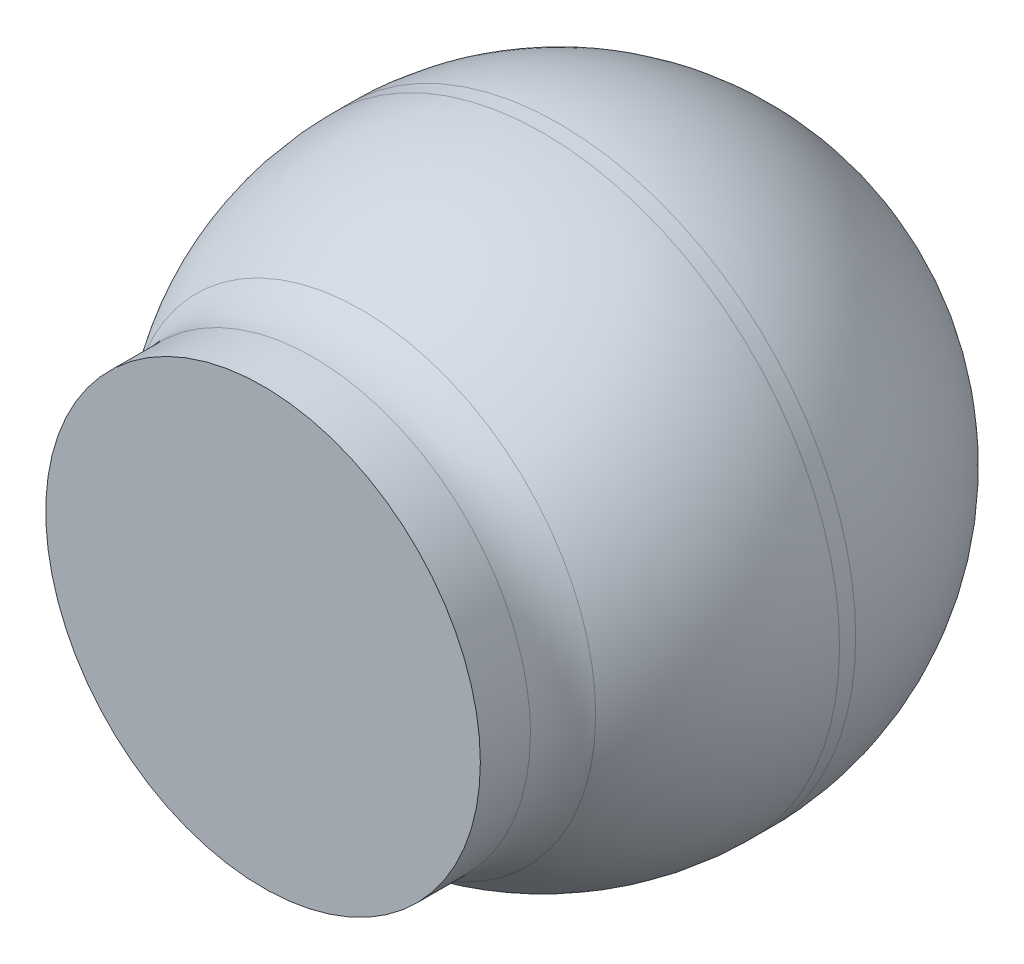
ISO-10303-21;
HEADER;
FILE_DESCRIPTION(('STEP AP214'),'2;1');
FILE_NAME('part.step','',(''),(''),'','','');
FILE_SCHEMA(('AUTOMOTIVE_DESIGN { 1 0 10303 214 1 1 1 1 }'));
ENDSEC;
DATA;
#1=APPLICATION_CONTEXT('core data for automotive mechanical design processes');
#2=APPLICATION_PROTOCOL_DEFINITION('international standard','automotive_design',2000,#1);
#3=PRODUCT_CONTEXT('',#1,'mechanical');
#4=PRODUCT('Part','Part','',(#3));
#5=PRODUCT_RELATED_PRODUCT_CATEGORY('part','',(#4));
#6=PRODUCT_DEFINITION_FORMATION('','',#4);
#7=PRODUCT_DEFINITION_CONTEXT('part definition',#1,'design');
#8=PRODUCT_DEFINITION('design','',#6,#7);
#9=PRODUCT_DEFINITION_SHAPE('','',#8);
#10=(LENGTH_UNIT() NAMED_UNIT(*) SI_UNIT(.MILLI.,.METRE.));
#11=(NAMED_UNIT(*) PLANE_ANGLE_UNIT() SI_UNIT($,.RADIAN.));
#12=(NAMED_UNIT(*) SI_UNIT($,.STERADIAN.) SOLID_ANGLE_UNIT());
#13=UNCERTAINTY_MEASURE_WITH_UNIT(LENGTH_MEASURE(1.E-05),#10,'distance_accuracy_value','');
#14=(GEOMETRIC_REPRESENTATION_CONTEXT(3) GLOBAL_UNCERTAINTY_ASSIGNED_CONTEXT((#13)) GLOBAL_UNIT_ASSIGNED_CONTEXT((#10,
#11,#12)) REPRESENTATION_CONTEXT('',''));
#15=CARTESIAN_POINT('',(0.,0.,0.));
#16=DIRECTION('',(0.,0.,1.));
#17=DIRECTION('',(1.,0.,0.));
#18=AXIS2_PLACEMENT_3D('',#15,#16,#17);
#19=CARTESIAN_POINT('',(1.977080077731,-2.781349291452,10.006534503384));
#20=DIRECTION('',(0.,0.,-1.));
#21=DIRECTION('',(-1.,0.,0.));
#22=AXIS2_PLACEMENT_3D('',#19,#20,#21);
#23=PLANE('',#22);
#24=CARTESIAN_POINT('',(1.977080077731,-2.781349291452,10.006534503384));
#25=DIRECTION('',(0.,0.,1.));
#26=DIRECTION('',(1.,0.,0.));
#27=AXIS2_PLACEMENT_3D('',#24,#25,#26);
#28=CIRCLE('',#27,0.275);
#29=CARTESIAN_POINT('',(2.252080077731,-2.781349291452,10.006534503384));
#30=VERTEX_POINT('',#29);
#31=EDGE_CURVE('E20',#30,#30,#28,.F.);
#32=ORIENTED_EDGE('',*,*,#31,.F.);
#33=EDGE_LOOP('',(#32));
#34=FACE_BOUND('',#33,.T.);
#35=ADVANCED_FACE('F17',(#34),#23,.F.);
#36=CARTESIAN_POINT('',(1.977080077731,-2.781349291452,9.906534503384));
#37=DIRECTION('',(0.,0.,1.));
#38=DIRECTION('',(1.,0.,0.));
#39=AXIS2_PLACEMENT_3D('',#36,#37,#38);
#40=CYLINDRICAL_SURFACE('',#39,0.275);
#41=CARTESIAN_POINT('',(1.977080077731,-2.781349291452,9.943180457728));
#42=DIRECTION('',(0.,0.,-1.));
#43=DIRECTION('',(0.996700902337582,0.0811622527992454,0.));
#44=AXIS2_PLACEMENT_3D('',#41,#42,#43);
#45=CIRCLE('',#44,0.275);
#46=CARTESIAN_POINT('',(2.25117282587384,-2.75902967193221,9.943180457728));
#47=VERTEX_POINT('',#46);
#48=EDGE_CURVE('E65',#47,#47,#45,.F.);
#49=ORIENTED_EDGE('',*,*,#48,.T.);
#50=EDGE_LOOP('',(#49));
#51=FACE_BOUND('',#50,.T.);
#52=ORIENTED_EDGE('',*,*,#31,.T.);
#53=EDGE_LOOP('',(#52));
#54=FACE_BOUND('',#53,.T.);
#55=ADVANCED_FACE('F62',(#51,#54),#40,.T.);
#56=CARTESIAN_POINT('',(1.977080077731,-2.781349291452,9.943180457728));
#57=DIRECTION('',(0.,0.,-1.));
#58=DIRECTION('',(0.996700902337583,0.081162252799246,0.));
#59=AXIS2_PLACEMENT_3D('',#56,#57,#58);
#60=TOROIDAL_SURFACE('',#59,0.375,0.1);
#61=ORIENTED_EDGE('',*,*,#48,.F.);
#62=EDGE_LOOP('',(#61));
#63=FACE_BOUND('',#62,.T.);
#64=CARTESIAN_POINT('',(1.977080077731,-2.781349291452,9.881744931236));
#65=DIRECTION('',(0.,0.,-1.));
#66=DIRECTION('',(-0.996700902337598,-0.0811622527990607,0.));
#67=AXIS2_PLACEMENT_3D('',#64,#65,#66);
#68=CIRCLE('',#67,0.296097046412665);
#69=CARTESIAN_POINT('',(1.681959884392,-2.805381194786,9.881744931236));
#70=VERTEX_POINT('',#69);
#71=EDGE_CURVE('E39',#70,#70,#68,.T.);
#72=ORIENTED_EDGE('',*,*,#71,.F.);
#73=EDGE_LOOP('',(#72));
#74=FACE_BOUND('',#73,.T.);
#75=ADVANCED_FACE('F57',(#63,#74),#60,.F.);
#76=CARTESIAN_POINT('',(1.603317239355,-2.811785136252,9.651976062157));
#77=CARTESIAN_POINT('',(1.603317239355,-2.811785136252,9.701461392103));
#78=CARTESIAN_POINT('',(1.611473782652,-2.811120941579,9.750947004335));
#79=CARTESIAN_POINT('',(1.627792914651,-2.809792059952,9.798626332798));
#80=CARTESIAN_POINT('',(1.651658609162,-2.807848654938,9.842699544317));
#81=CARTESIAN_POINT('',(1.681959884392,-2.805381194786,9.881744931236));
#82=(BOUNDED_CURVE() B_SPLINE_CURVE(5,(#76,#77,#78,#79,#80,#81),.UNSPECIFIED.,.F.,
.F.) B_SPLINE_CURVE_WITH_KNOTS((6,6),(0.,0.661568582165),
.UNSPECIFIED.) CURVE() GEOMETRIC_REPRESENTATION_ITEM() RATIONAL_B_SPLINE_CURVE((1.,1.,1.,1.,1.,1.)) REPRESENTATION_ITEM(''));
#83=CARTESIAN_POINT('',(1.977080077731,-2.781349291452,9.651976062157));
#84=DIRECTION('',(0.,0.,-1.));
#85=AXIS1_PLACEMENT('',#83,#84);
#86=SURFACE_OF_REVOLUTION('',#82,#85);
#87=CARTESIAN_POINT('',(1.977080077731,-2.781349291452,9.651976062157));
#88=DIRECTION('',(0.,0.,1.));
#89=DIRECTION('',(1.,0.,0.));
#90=AXIS2_PLACEMENT_3D('',#87,#88,#89);
#91=CIRCLE('',#90,0.375);
#92=CARTESIAN_POINT('',(2.352080077731,-2.781349291452,9.651976062157));
#93=VERTEX_POINT('',#92);
#94=EDGE_CURVE('E36',#93,#93,#91,.F.);
#95=ORIENTED_EDGE('',*,*,#94,.F.);
#96=EDGE_LOOP('',(#95));
#97=FACE_BOUND('',#96,.T.);
#98=ORIENTED_EDGE('',*,*,#71,.T.);
#99=EDGE_LOOP('',(#98));
#100=FACE_BOUND('',#99,.T.);
#101=ADVANCED_FACE('F53',(#97,#100),#86,.F.);
#102=CARTESIAN_POINT('',(1.977080077731,-2.781349291452,9.256534503384));
#103=DIRECTION('',(0.,0.,1.));
#104=DIRECTION('',(1.,0.,0.));
#105=AXIS2_PLACEMENT_3D('',#102,#103,#104);
#106=CYLINDRICAL_SURFACE('',#105,0.375);
#107=CARTESIAN_POINT('',(1.977080077731,-2.781349291452,9.631534503384));
#108=DIRECTION('',(0.,0.,-1.));
#109=DIRECTION('',(0.0811622527992356,-0.996700902337583,0.));
#110=AXIS2_PLACEMENT_3D('',#107,#108,#109);
#111=CIRCLE('',#110,0.375);
#112=CARTESIAN_POINT('',(2.00751592253071,-3.15511212982859,9.631534503384));
#113=VERTEX_POINT('',#112);
#114=CARTESIAN_POINT('',(1.94664423293129,-2.40758645307541,9.631534503384));
#115=VERTEX_POINT('',#114);
#116=EDGE_CURVE('E11',#113,#115,#111,.T.);
#117=ORIENTED_EDGE('',*,*,#116,.F.);
#118=CARTESIAN_POINT('',(1.977080077731,-2.781349291452,9.631534503384));
#119=DIRECTION('',(0.,0.,1.));
#120=DIRECTION('',(0.0811622527992366,-0.996700902337583,0.));
#121=AXIS2_PLACEMENT_3D('',#118,#119,#120);
#122=CIRCLE('',#121,0.375);
#123=EDGE_CURVE('E25',#115,#113,#122,.F.);
#124=ORIENTED_EDGE('',*,*,#123,.F.);
#125=EDGE_LOOP('',(#117,#124));
#126=FACE_BOUND('',#125,.T.);
#127=ORIENTED_EDGE('',*,*,#94,.T.);
#128=EDGE_LOOP('',(#127));
#129=FACE_BOUND('',#128,.T.);
#130=ADVANCED_FACE('F34',(#126,#129),#106,.T.);
#131=CARTESIAN_POINT('',(1.977080077731,-2.781349291452,9.631534503384));
#132=DIRECTION('',(0.0811622527992361,-0.996700902337583,0.));
#133=DIRECTION('',(-0.996700902337583,-0.0811622527992361,0.));
#134=AXIS2_PLACEMENT_3D('',#131,#132,#133);
#135=SPHERICAL_SURFACE('',#134,0.375);
#136=ORIENTED_EDGE('',*,*,#123,.T.);
#137=ORIENTED_EDGE('',*,*,#116,.T.);
#138=EDGE_LOOP('',(#136,#137));
#139=FACE_BOUND('',#138,.T.);
#140=ADVANCED_FACE('F32',(#139),#135,.T.);
#141=CLOSED_SHELL('',(#35,#55,#75,#101,#130,#140));
#142=MANIFOLD_SOLID_BREP('B1',#141);
#143=ADVANCED_BREP_SHAPE_REPRESENTATION('',(#18,#142),#14);
#144=SHAPE_DEFINITION_REPRESENTATION(#9,#143);
ENDSEC;
END-ISO-10303-21;
